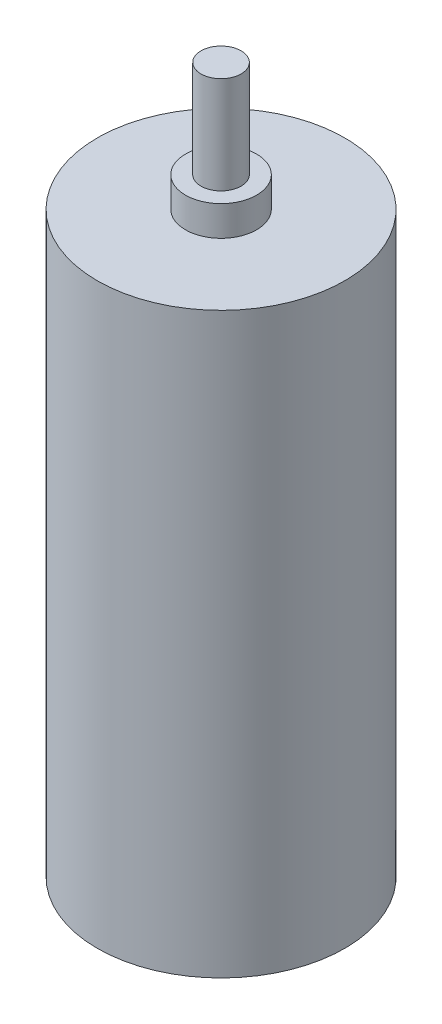
ISO-10303-21;
HEADER;
FILE_DESCRIPTION(('STEP AP214'),'2;1');
FILE_NAME('part.step','',(''),(''),'','','');
FILE_SCHEMA(('AUTOMOTIVE_DESIGN { 1 0 10303 214 1 1 1 1 }'));
ENDSEC;
DATA;
#1=APPLICATION_CONTEXT('core data for automotive mechanical design processes');
#2=APPLICATION_PROTOCOL_DEFINITION('international standard','automotive_design',2000,#1);
#3=PRODUCT_CONTEXT('',#1,'mechanical');
#4=PRODUCT('Part','Part','',(#3));
#5=PRODUCT_RELATED_PRODUCT_CATEGORY('part','',(#4));
#6=PRODUCT_DEFINITION_FORMATION('','',#4);
#7=PRODUCT_DEFINITION_CONTEXT('part definition',#1,'design');
#8=PRODUCT_DEFINITION('design','',#6,#7);
#9=PRODUCT_DEFINITION_SHAPE('','',#8);
#10=(LENGTH_UNIT() NAMED_UNIT(*) SI_UNIT(.MILLI.,.METRE.));
#11=(NAMED_UNIT(*) PLANE_ANGLE_UNIT() SI_UNIT($,.RADIAN.));
#12=(NAMED_UNIT(*) SI_UNIT($,.STERADIAN.) SOLID_ANGLE_UNIT());
#13=UNCERTAINTY_MEASURE_WITH_UNIT(LENGTH_MEASURE(1.E-05),#10,'distance_accuracy_value','');
#14=(GEOMETRIC_REPRESENTATION_CONTEXT(3) GLOBAL_UNCERTAINTY_ASSIGNED_CONTEXT((#13)) GLOBAL_UNIT_ASSIGNED_CONTEXT((#10,
#11,#12)) REPRESENTATION_CONTEXT('',''));
#15=CARTESIAN_POINT('',(0.,0.,0.));
#16=DIRECTION('',(0.,0.,1.));
#17=DIRECTION('',(1.,0.,0.));
#18=AXIS2_PLACEMENT_3D('',#15,#16,#17);
#19=CARTESIAN_POINT('',(0.,57.7,0.));
#20=DIRECTION('',(0.,-1.,0.));
#21=DIRECTION('',(0.,0.,-1.));
#22=AXIS2_PLACEMENT_3D('',#19,#20,#21);
#23=CYLINDRICAL_SURFACE('',#22,12.35);
#24=CARTESIAN_POINT('',(0.,57.7,0.));
#25=DIRECTION('',(0.,1.,0.));
#26=DIRECTION('',(0.,0.,1.));
#27=AXIS2_PLACEMENT_3D('',#24,#25,#26);
#28=CIRCLE('',#27,12.35);
#29=CARTESIAN_POINT('',(0.,57.7,12.35));
#30=VERTEX_POINT('',#29);
#31=EDGE_CURVE('E56',#30,#30,#28,.T.);
#32=ORIENTED_EDGE('',*,*,#31,.F.);
#33=EDGE_LOOP('',(#32));
#34=FACE_BOUND('',#33,.T.);
#35=CARTESIAN_POINT('',(0.,0.,0.));
#36=DIRECTION('',(0.,1.,0.));
#37=DIRECTION('',(0.,0.,1.));
#38=AXIS2_PLACEMENT_3D('',#35,#36,#37);
#39=CIRCLE('',#38,12.35);
#40=CARTESIAN_POINT('',(0.,0.,12.35));
#41=VERTEX_POINT('',#40);
#42=EDGE_CURVE('E45',#41,#41,#39,.T.);
#43=ORIENTED_EDGE('',*,*,#42,.T.);
#44=EDGE_LOOP('',(#43));
#45=FACE_BOUND('',#44,.T.);
#46=ADVANCED_FACE('F42',(#34,#45),#23,.T.);
#47=CARTESIAN_POINT('',(0.,57.7,0.));
#48=DIRECTION('',(0.,1.,0.));
#49=DIRECTION('',(0.,0.,1.));
#50=AXIS2_PLACEMENT_3D('',#47,#48,#49);
#51=PLANE('',#50);
#52=CARTESIAN_POINT('',(0.,57.7,0.));
#53=DIRECTION('',(0.,1.,0.));
#54=DIRECTION('',(0.,0.,1.));
#55=AXIS2_PLACEMENT_3D('',#52,#53,#54);
#56=CIRCLE('',#55,3.55);
#57=CARTESIAN_POINT('',(0.,57.7,3.55));
#58=VERTEX_POINT('',#57);
#59=EDGE_CURVE('E50',#58,#58,#56,.T.);
#60=ORIENTED_EDGE('',*,*,#59,.F.);
#61=EDGE_LOOP('',(#60));
#62=FACE_BOUND('',#61,.T.);
#63=ORIENTED_EDGE('',*,*,#31,.T.);
#64=EDGE_LOOP('',(#63));
#65=FACE_BOUND('',#64,.T.);
#66=ADVANCED_FACE('F76',(#62,#65),#51,.T.);
#67=CARTESIAN_POINT('',(0.,0.,0.));
#68=DIRECTION('',(0.,1.,0.));
#69=DIRECTION('',(0.,0.,1.));
#70=AXIS2_PLACEMENT_3D('',#67,#68,#69);
#71=PLANE('',#70);
#72=ORIENTED_EDGE('',*,*,#42,.F.);
#73=EDGE_LOOP('',(#72));
#74=FACE_BOUND('',#73,.T.);
#75=ADVANCED_FACE('F73',(#74),#71,.F.);
#76=CARTESIAN_POINT('',(0.,60.7,0.));
#77=DIRECTION('',(0.,-1.,0.));
#78=DIRECTION('',(0.,0.,-1.));
#79=AXIS2_PLACEMENT_3D('',#76,#77,#78);
#80=CYLINDRICAL_SURFACE('',#79,3.55);
#81=CARTESIAN_POINT('',(0.,60.7,0.));
#82=DIRECTION('',(0.,1.,0.));
#83=DIRECTION('',(0.,0.,1.));
#84=AXIS2_PLACEMENT_3D('',#81,#82,#83);
#85=CIRCLE('',#84,3.55);
#86=CARTESIAN_POINT('',(0.,60.7,3.55));
#87=VERTEX_POINT('',#86);
#88=EDGE_CURVE('E61',#87,#87,#85,.T.);
#89=ORIENTED_EDGE('',*,*,#88,.F.);
#90=EDGE_LOOP('',(#89));
#91=FACE_BOUND('',#90,.T.);
#92=ORIENTED_EDGE('',*,*,#59,.T.);
#93=EDGE_LOOP('',(#92));
#94=FACE_BOUND('',#93,.T.);
#95=ADVANCED_FACE('F75',(#91,#94),#80,.T.);
#96=CARTESIAN_POINT('',(0.,60.7,0.));
#97=DIRECTION('',(0.,1.,0.));
#98=DIRECTION('',(0.,0.,1.));
#99=AXIS2_PLACEMENT_3D('',#96,#97,#98);
#100=PLANE('',#99);
#101=CARTESIAN_POINT('',(0.,60.7,0.));
#102=DIRECTION('',(0.,1.,0.));
#103=DIRECTION('',(0.,0.,1.));
#104=AXIS2_PLACEMENT_3D('',#101,#102,#103);
#105=CIRCLE('',#104,2.);
#106=CARTESIAN_POINT('',(0.,60.7,2.));
#107=VERTEX_POINT('',#106);
#108=EDGE_CURVE('E10',#107,#107,#105,.T.);
#109=ORIENTED_EDGE('',*,*,#108,.F.);
#110=EDGE_LOOP('',(#109));
#111=FACE_BOUND('',#110,.T.);
#112=ORIENTED_EDGE('',*,*,#88,.T.);
#113=EDGE_LOOP('',(#112));
#114=FACE_BOUND('',#113,.T.);
#115=ADVANCED_FACE('F82',(#111,#114),#100,.T.);
#116=CARTESIAN_POINT('',(0.,70.4,0.));
#117=DIRECTION('',(0.,-1.,0.));
#118=DIRECTION('',(0.,0.,-1.));
#119=AXIS2_PLACEMENT_3D('',#116,#117,#118);
#120=CYLINDRICAL_SURFACE('',#119,2.);
#121=CARTESIAN_POINT('',(0.,70.4,0.));
#122=DIRECTION('',(0.,1.,0.));
#123=DIRECTION('',(0.,0.,1.));
#124=AXIS2_PLACEMENT_3D('',#121,#122,#123);
#125=CIRCLE('',#124,2.);
#126=CARTESIAN_POINT('',(0.,70.4,2.));
#127=VERTEX_POINT('',#126);
#128=EDGE_CURVE('E60',#127,#127,#125,.T.);
#129=ORIENTED_EDGE('',*,*,#128,.F.);
#130=EDGE_LOOP('',(#129));
#131=FACE_BOUND('',#130,.T.);
#132=ORIENTED_EDGE('',*,*,#108,.T.);
#133=EDGE_LOOP('',(#132));
#134=FACE_BOUND('',#133,.T.);
#135=ADVANCED_FACE('F116',(#131,#134),#120,.T.);
#136=CARTESIAN_POINT('',(0.,70.4,0.));
#137=DIRECTION('',(0.,1.,0.));
#138=DIRECTION('',(0.,0.,1.));
#139=AXIS2_PLACEMENT_3D('',#136,#137,#138);
#140=PLANE('',#139);
#141=ORIENTED_EDGE('',*,*,#128,.T.);
#142=EDGE_LOOP('',(#141));
#143=FACE_BOUND('',#142,.T.);
#144=ADVANCED_FACE('F126',(#143),#140,.T.);
#145=CLOSED_SHELL('',(#46,#66,#75,#95,#115,#135,#144));
#146=MANIFOLD_SOLID_BREP('B2',#145);
#147=ADVANCED_BREP_SHAPE_REPRESENTATION('',(#18,#146),#14);
#148=SHAPE_DEFINITION_REPRESENTATION(#9,#147);
ENDSEC;
END-ISO-10303-21;
